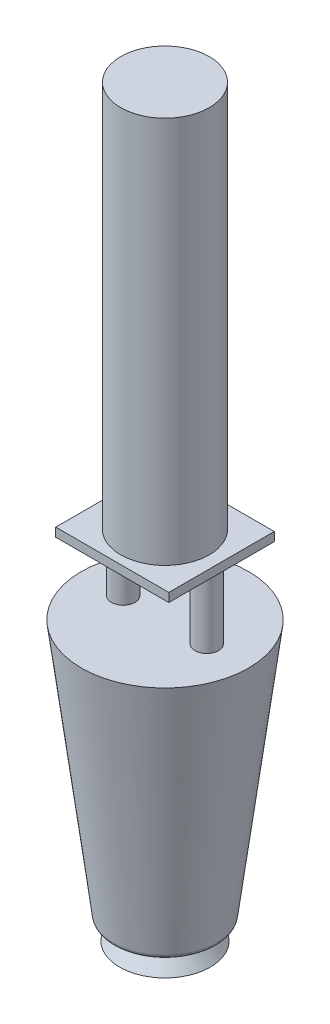
ISO-10303-21;
HEADER;
FILE_DESCRIPTION(('STEP AP214'),'2;1');
FILE_NAME('part.step','',(''),(''),'','','');
FILE_SCHEMA(('AUTOMOTIVE_DESIGN { 1 0 10303 214 1 1 1 1 }'));
ENDSEC;
DATA;
#1=APPLICATION_CONTEXT('core data for automotive mechanical design processes');
#2=APPLICATION_PROTOCOL_DEFINITION('international standard','automotive_design',2000,#1);
#3=PRODUCT_CONTEXT('',#1,'mechanical');
#4=PRODUCT('Part','Part','',(#3));
#5=PRODUCT_RELATED_PRODUCT_CATEGORY('part','',(#4));
#6=PRODUCT_DEFINITION_FORMATION('','',#4);
#7=PRODUCT_DEFINITION_CONTEXT('part definition',#1,'design');
#8=PRODUCT_DEFINITION('design','',#6,#7);
#9=PRODUCT_DEFINITION_SHAPE('','',#8);
#10=(LENGTH_UNIT() NAMED_UNIT(*) SI_UNIT(.MILLI.,.METRE.));
#11=(NAMED_UNIT(*) PLANE_ANGLE_UNIT() SI_UNIT($,.RADIAN.));
#12=(NAMED_UNIT(*) SI_UNIT($,.STERADIAN.) SOLID_ANGLE_UNIT());
#13=UNCERTAINTY_MEASURE_WITH_UNIT(LENGTH_MEASURE(1.E-05),#10,'distance_accuracy_value','');
#14=(GEOMETRIC_REPRESENTATION_CONTEXT(3) GLOBAL_UNCERTAINTY_ASSIGNED_CONTEXT((#13)) GLOBAL_UNIT_ASSIGNED_CONTEXT((#10,
#11,#12)) REPRESENTATION_CONTEXT('',''));
#15=CARTESIAN_POINT('',(0.,0.,0.));
#16=DIRECTION('',(0.,0.,1.));
#17=DIRECTION('',(1.,0.,0.));
#18=AXIS2_PLACEMENT_3D('',#15,#16,#17);
#19=CARTESIAN_POINT('',(10.3081724625253,0.,0.));
#20=DIRECTION('',(0.,-1.,0.));
#21=DIRECTION('',(0.,0.,-1.));
#22=AXIS2_PLACEMENT_3D('',#19,#20,#21);
#23=PLANE('',#22);
#24=CARTESIAN_POINT('',(0.,0.,0.));
#25=DIRECTION('',(0.,-1.,0.));
#26=DIRECTION('',(0.,0.,-1.));
#27=AXIS2_PLACEMENT_3D('',#24,#25,#26);
#28=CIRCLE('',#27,10.3081724625253);
#29=CARTESIAN_POINT('',(0.,0.,-10.3081724625253));
#30=VERTEX_POINT('',#29);
#31=EDGE_CURVE('E121',#30,#30,#28,.T.);
#32=ORIENTED_EDGE('',*,*,#31,.T.);
#33=EDGE_LOOP('',(#32));
#34=FACE_BOUND('',#33,.T.);
#35=ADVANCED_FACE('F39',(#34),#23,.T.);
#36=CARTESIAN_POINT('',(0.,63.2,0.));
#37=DIRECTION('',(0.,1.,0.));
#38=DIRECTION('',(0.,0.,1.));
#39=AXIS2_PLACEMENT_3D('',#36,#37,#38);
#40=PLANE('',#39);
#41=CARTESIAN_POINT('',(-9.4887541244929,63.2,0.));
#42=DIRECTION('',(0.,1.,0.));
#43=DIRECTION('',(0.,0.,1.));
#44=AXIS2_PLACEMENT_3D('',#41,#42,#43);
#45=CIRCLE('',#44,2.67336269963787);
#46=CARTESIAN_POINT('',(-9.4887541244929,63.2,2.67336269963787));
#47=VERTEX_POINT('',#46);
#48=EDGE_CURVE('E11',#47,#47,#45,.T.);
#49=ORIENTED_EDGE('',*,*,#48,.F.);
#50=EDGE_LOOP('',(#49));
#51=FACE_BOUND('',#50,.T.);
#52=CARTESIAN_POINT('',(9.4887541244929,63.2,0.));
#53=DIRECTION('',(0.,1.,0.));
#54=DIRECTION('',(0.,0.,1.));
#55=AXIS2_PLACEMENT_3D('',#52,#53,#54);
#56=CIRCLE('',#55,2.67336269963787);
#57=CARTESIAN_POINT('',(9.4887541244929,63.2,2.67336269963787));
#58=VERTEX_POINT('',#57);
#59=EDGE_CURVE('E48',#58,#58,#56,.T.);
#60=ORIENTED_EDGE('',*,*,#59,.F.);
#61=EDGE_LOOP('',(#60));
#62=FACE_BOUND('',#61,.T.);
#63=CARTESIAN_POINT('',(0.,63.2,0.));
#64=DIRECTION('',(0.,-1.,0.));
#65=DIRECTION('',(0.,0.,-1.));
#66=AXIS2_PLACEMENT_3D('',#63,#64,#65);
#67=CIRCLE('',#66,19.);
#68=CARTESIAN_POINT('',(0.,63.2,-19.));
#69=VERTEX_POINT('',#68);
#70=EDGE_CURVE('E129',#69,#69,#67,.T.);
#71=ORIENTED_EDGE('',*,*,#70,.F.);
#72=EDGE_LOOP('',(#71));
#73=FACE_BOUND('',#72,.T.);
#74=ADVANCED_FACE('F142',(#51,#62,#73),#40,.T.);
#75=CARTESIAN_POINT('',(0.,4.55529285160393,0.));
#76=DIRECTION('',(0.,1.,0.));
#77=DIRECTION('',(0.,0.,1.));
#78=AXIS2_PLACEMENT_3D('',#75,#76,#77);
#79=CONICAL_SURFACE('',#78,11.588395286118,0.125714986083952);
#80=CARTESIAN_POINT('',(0.,5.42990874262173,0.));
#81=DIRECTION('',(0.,-1.,0.));
#82=DIRECTION('',(0.,0.,-1.));
#83=AXIS2_PLACEMENT_3D('',#80,#81,#82);
#84=CIRCLE('',#83,11.6989305343255);
#85=CARTESIAN_POINT('',(0.,5.42990874262173,-11.6989305343255));
#86=VERTEX_POINT('',#85);
#87=EDGE_CURVE('E135',#86,#86,#84,.F.);
#88=ORIENTED_EDGE('',*,*,#87,.T.);
#89=EDGE_LOOP('',(#88));
#90=FACE_BOUND('',#89,.T.);
#91=ORIENTED_EDGE('',*,*,#70,.T.);
#92=EDGE_LOOP('',(#91));
#93=FACE_BOUND('',#92,.T.);
#94=ADVANCED_FACE('F145',(#90,#93),#79,.T.);
#95=CARTESIAN_POINT('',(11.588395286118,4.55529285160393,0.));
#96=DIRECTION('',(0.,-1.,0.));
#97=DIRECTION('',(0.,0.,-1.));
#98=AXIS2_PLACEMENT_3D('',#95,#96,#97);
#99=PLANE('',#98);
#100=CARTESIAN_POINT('',(0.,4.55529285160393,0.));
#101=DIRECTION('',(0.,-1.,0.));
#102=DIRECTION('',(0.,0.,-1.));
#103=AXIS2_PLACEMENT_3D('',#100,#101,#102);
#104=CIRCLE('',#103,10.7068222613962);
#105=CARTESIAN_POINT('',(0.,4.55529285160393,-10.7068222613962));
#106=VERTEX_POINT('',#105);
#107=EDGE_CURVE('E132',#106,#106,#104,.T.);
#108=ORIENTED_EDGE('',*,*,#107,.T.);
#109=EDGE_LOOP('',(#108));
#110=FACE_BOUND('',#109,.T.);
#111=CARTESIAN_POINT('',(0.,4.55529285160393,0.));
#112=DIRECTION('',(0.,-1.,0.));
#113=DIRECTION('',(0.,0.,-1.));
#114=AXIS2_PLACEMENT_3D('',#111,#112,#113);
#115=CIRCLE('',#114,6.62753184469628);
#116=CARTESIAN_POINT('',(0.,4.55529285160393,-6.62753184469628));
#117=VERTEX_POINT('',#116);
#118=EDGE_CURVE('E126',#117,#117,#115,.T.);
#119=ORIENTED_EDGE('',*,*,#118,.F.);
#120=EDGE_LOOP('',(#119));
#121=FACE_BOUND('',#120,.T.);
#122=ADVANCED_FACE('F151',(#110,#121),#99,.T.);
#123=CARTESIAN_POINT('',(0.,0.,0.));
#124=DIRECTION('',(0.,-1.,0.));
#125=DIRECTION('',(0.,0.,-1.));
#126=AXIS2_PLACEMENT_3D('',#123,#124,#125);
#127=CONICAL_SURFACE('',#126,10.3081724625253,0.679595208288886);
#128=ORIENTED_EDGE('',*,*,#118,.T.);
#129=EDGE_LOOP('',(#128));
#130=FACE_BOUND('',#129,.T.);
#131=ORIENTED_EDGE('',*,*,#31,.F.);
#132=EDGE_LOOP('',(#131));
#133=FACE_BOUND('',#132,.T.);
#134=ADVANCED_FACE('F157',(#130,#133),#127,.T.);
#135=CARTESIAN_POINT('',(0.,5.55529285160393,0.));
#136=DIRECTION('',(0.,-1.,0.));
#137=DIRECTION('',(0.,0.,-1.));
#138=AXIS2_PLACEMENT_3D('',#135,#136,#137);
#139=TOROIDAL_SURFACE('',#138,10.7068222613962,1.);
#140=ORIENTED_EDGE('',*,*,#87,.F.);
#141=EDGE_LOOP('',(#140));
#142=FACE_BOUND('',#141,.T.);
#143=ORIENTED_EDGE('',*,*,#107,.F.);
#144=EDGE_LOOP('',(#143));
#145=FACE_BOUND('',#144,.T.);
#146=ADVANCED_FACE('F41',(#142,#145),#139,.T.);
#147=CARTESIAN_POINT('',(9.4887541244929,63.2,0.));
#148=DIRECTION('',(0.,-1.,0.));
#149=DIRECTION('',(0.,0.,-1.));
#150=AXIS2_PLACEMENT_3D('',#147,#148,#149);
#151=CYLINDRICAL_SURFACE('',#150,2.67336269963787);
#152=CARTESIAN_POINT('',(9.4887541244929,79.,0.));
#153=DIRECTION('',(0.,-1.,0.));
#154=DIRECTION('',(0.,0.,-1.));
#155=AXIS2_PLACEMENT_3D('',#152,#153,#154);
#156=CIRCLE('',#155,2.67336269963787);
#157=CARTESIAN_POINT('',(9.4887541244929,79.,-2.67336269963787));
#158=VERTEX_POINT('',#157);
#159=EDGE_CURVE('E117',#158,#158,#156,.T.);
#160=ORIENTED_EDGE('',*,*,#159,.T.);
#161=EDGE_LOOP('',(#160));
#162=FACE_BOUND('',#161,.T.);
#163=ORIENTED_EDGE('',*,*,#59,.T.);
#164=EDGE_LOOP('',(#163));
#165=FACE_BOUND('',#164,.T.);
#166=ADVANCED_FACE('F140',(#162,#165),#151,.T.);
#167=CARTESIAN_POINT('',(-9.4887541244929,63.2,0.));
#168=DIRECTION('',(0.,-1.,0.));
#169=DIRECTION('',(0.,0.,-1.));
#170=AXIS2_PLACEMENT_3D('',#167,#168,#169);
#171=CYLINDRICAL_SURFACE('',#170,2.67336269963787);
#172=CARTESIAN_POINT('',(-9.4887541244929,79.,0.));
#173=DIRECTION('',(0.,1.,0.));
#174=DIRECTION('',(0.,0.,-1.));
#175=AXIS2_PLACEMENT_3D('',#172,#173,#174);
#176=CIRCLE('',#175,2.67336269963787);
#177=CARTESIAN_POINT('',(-9.4887541244929,79.,-2.67336269963787));
#178=VERTEX_POINT('',#177);
#179=EDGE_CURVE('E118',#178,#178,#176,.T.);
#180=ORIENTED_EDGE('',*,*,#179,.F.);
#181=EDGE_LOOP('',(#180));
#182=FACE_BOUND('',#181,.T.);
#183=ORIENTED_EDGE('',*,*,#48,.T.);
#184=EDGE_LOOP('',(#183));
#185=FACE_BOUND('',#184,.T.);
#186=ADVANCED_FACE('F176',(#182,#185),#171,.T.);
#187=CARTESIAN_POINT('',(0.,79.,0.));
#188=DIRECTION('',(0.,-1.,0.));
#189=DIRECTION('',(0.,0.,-1.));
#190=AXIS2_PLACEMENT_3D('',#187,#188,#189);
#191=PLANE('',#190);
#192=ORIENTED_EDGE('',*,*,#179,.T.);
#193=EDGE_LOOP('',(#192));
#194=FACE_BOUND('',#193,.T.);
#195=DIRECTION('',(0.,0.,-1.));
#196=VECTOR('',#195,1.);
#197=CARTESIAN_POINT('',(12.8452737027014,79.,11.9793001946544));
#198=LINE('',#197,#196);
#199=CARTESIAN_POINT('',(12.8452737027014,79.,11.9793001946544));
#200=VERTEX_POINT('',#199);
#201=CARTESIAN_POINT('',(12.8452737027014,79.,-11.9793001946544));
#202=VERTEX_POINT('',#201);
#203=EDGE_CURVE('E107',#200,#202,#198,.T.);
#204=ORIENTED_EDGE('',*,*,#203,.F.);
#205=DIRECTION('',(1.,0.,0.));
#206=VECTOR('',#205,1.);
#207=CARTESIAN_POINT('',(-12.8452737027014,79.,11.9793001946544));
#208=LINE('',#207,#206);
#209=CARTESIAN_POINT('',(-12.8452737027014,79.,11.9793001946544));
#210=VERTEX_POINT('',#209);
#211=EDGE_CURVE('E79',#210,#200,#208,.T.);
#212=ORIENTED_EDGE('',*,*,#211,.F.);
#213=DIRECTION('',(0.,0.,1.));
#214=VECTOR('',#213,1.);
#215=CARTESIAN_POINT('',(-12.8452737027014,79.,11.9793001946544));
#216=LINE('',#215,#214);
#217=CARTESIAN_POINT('',(-12.8452737027014,79.,-11.9793001946544));
#218=VERTEX_POINT('',#217);
#219=EDGE_CURVE('E73',#218,#210,#216,.T.);
#220=ORIENTED_EDGE('',*,*,#219,.F.);
#221=DIRECTION('',(-1.,0.,0.));
#222=VECTOR('',#221,1.);
#223=CARTESIAN_POINT('',(-12.8452737027014,79.,-11.9793001946544));
#224=LINE('',#223,#222);
#225=EDGE_CURVE('E97',#202,#218,#224,.T.);
#226=ORIENTED_EDGE('',*,*,#225,.F.);
#227=EDGE_LOOP('',(#204,#212,#220,#226));
#228=FACE_BOUND('',#227,.T.);
#229=ORIENTED_EDGE('',*,*,#159,.F.);
#230=EDGE_LOOP('',(#229));
#231=FACE_BOUND('',#230,.T.);
#232=ADVANCED_FACE('F180',(#194,#228,#231),#191,.T.);
#233=CARTESIAN_POINT('',(12.8452737027014,81.,11.9793001946544));
#234=DIRECTION('',(-1.,0.,0.));
#235=DIRECTION('',(0.,0.,1.));
#236=AXIS2_PLACEMENT_3D('',#233,#234,#235);
#237=PLANE('',#236);
#238=ORIENTED_EDGE('',*,*,#203,.T.);
#239=DIRECTION('',(0.,-1.,0.));
#240=VECTOR('',#239,1.);
#241=CARTESIAN_POINT('',(12.8452737027014,81.,-11.9793001946544));
#242=LINE('',#241,#240);
#243=CARTESIAN_POINT('',(12.8452737027014,81.,-11.9793001946544));
#244=VERTEX_POINT('',#243);
#245=EDGE_CURVE('E98',#244,#202,#242,.T.);
#246=ORIENTED_EDGE('',*,*,#245,.F.);
#247=DIRECTION('',(0.,0.,-1.));
#248=VECTOR('',#247,1.);
#249=CARTESIAN_POINT('',(12.8452737027014,81.,11.9793001946544));
#250=LINE('',#249,#248);
#251=CARTESIAN_POINT('',(12.8452737027014,81.,11.9793001946544));
#252=VERTEX_POINT('',#251);
#253=EDGE_CURVE('E92',#252,#244,#250,.T.);
#254=ORIENTED_EDGE('',*,*,#253,.F.);
#255=DIRECTION('',(0.,-1.,0.));
#256=VECTOR('',#255,1.);
#257=CARTESIAN_POINT('',(12.8452737027014,81.,11.9793001946544));
#258=LINE('',#257,#256);
#259=EDGE_CURVE('E103',#252,#200,#258,.T.);
#260=ORIENTED_EDGE('',*,*,#259,.T.);
#261=EDGE_LOOP('',(#238,#246,#254,#260));
#262=FACE_BOUND('',#261,.T.);
#263=ADVANCED_FACE('F182',(#262),#237,.F.);
#264=CARTESIAN_POINT('',(-12.8452737027014,81.,-11.9793001946544));
#265=DIRECTION('',(0.,0.,1.));
#266=DIRECTION('',(1.,0.,0.));
#267=AXIS2_PLACEMENT_3D('',#264,#265,#266);
#268=PLANE('',#267);
#269=ORIENTED_EDGE('',*,*,#225,.T.);
#270=DIRECTION('',(0.,-1.,0.));
#271=VECTOR('',#270,1.);
#272=CARTESIAN_POINT('',(-12.8452737027014,81.,-11.9793001946544));
#273=LINE('',#272,#271);
#274=CARTESIAN_POINT('',(-12.8452737027014,81.,-11.9793001946544));
#275=VERTEX_POINT('',#274);
#276=EDGE_CURVE('E95',#275,#218,#273,.T.);
#277=ORIENTED_EDGE('',*,*,#276,.F.);
#278=DIRECTION('',(-1.,0.,0.));
#279=VECTOR('',#278,1.);
#280=CARTESIAN_POINT('',(-12.8452737027014,81.,-11.9793001946544));
#281=LINE('',#280,#279);
#282=EDGE_CURVE('E87',#244,#275,#281,.T.);
#283=ORIENTED_EDGE('',*,*,#282,.F.);
#284=ORIENTED_EDGE('',*,*,#245,.T.);
#285=EDGE_LOOP('',(#269,#277,#283,#284));
#286=FACE_BOUND('',#285,.T.);
#287=ADVANCED_FACE('F96',(#286),#268,.F.);
#288=CARTESIAN_POINT('',(-12.8452737027014,81.,11.9793001946544));
#289=DIRECTION('',(1.,0.,0.));
#290=DIRECTION('',(0.,0.,-1.));
#291=AXIS2_PLACEMENT_3D('',#288,#289,#290);
#292=PLANE('',#291);
#293=ORIENTED_EDGE('',*,*,#219,.T.);
#294=DIRECTION('',(0.,-1.,0.));
#295=VECTOR('',#294,1.);
#296=CARTESIAN_POINT('',(-12.8452737027014,81.,11.9793001946544));
#297=LINE('',#296,#295);
#298=CARTESIAN_POINT('',(-12.8452737027014,81.,11.9793001946544));
#299=VERTEX_POINT('',#298);
#300=EDGE_CURVE('E99',#299,#210,#297,.T.);
#301=ORIENTED_EDGE('',*,*,#300,.F.);
#302=DIRECTION('',(0.,0.,1.));
#303=VECTOR('',#302,1.);
#304=CARTESIAN_POINT('',(-12.8452737027014,81.,11.9793001946544));
#305=LINE('',#304,#303);
#306=EDGE_CURVE('E90',#275,#299,#305,.T.);
#307=ORIENTED_EDGE('',*,*,#306,.F.);
#308=ORIENTED_EDGE('',*,*,#276,.T.);
#309=EDGE_LOOP('',(#293,#301,#307,#308));
#310=FACE_BOUND('',#309,.T.);
#311=ADVANCED_FACE('F101',(#310),#292,.F.);
#312=CARTESIAN_POINT('',(-12.8452737027014,81.,11.9793001946544));
#313=DIRECTION('',(0.,0.,-1.));
#314=DIRECTION('',(-1.,0.,0.));
#315=AXIS2_PLACEMENT_3D('',#312,#313,#314);
#316=PLANE('',#315);
#317=ORIENTED_EDGE('',*,*,#211,.T.);
#318=ORIENTED_EDGE('',*,*,#259,.F.);
#319=DIRECTION('',(1.,0.,0.));
#320=VECTOR('',#319,1.);
#321=CARTESIAN_POINT('',(-12.8452737027014,81.,11.9793001946544));
#322=LINE('',#321,#320);
#323=EDGE_CURVE('E56',#299,#252,#322,.T.);
#324=ORIENTED_EDGE('',*,*,#323,.F.);
#325=ORIENTED_EDGE('',*,*,#300,.T.);
#326=EDGE_LOOP('',(#317,#318,#324,#325));
#327=FACE_BOUND('',#326,.T.);
#328=ADVANCED_FACE('F190',(#327),#316,.F.);
#329=CARTESIAN_POINT('',(0.,81.,0.));
#330=DIRECTION('',(0.,-1.,0.));
#331=DIRECTION('',(0.,0.,-1.));
#332=AXIS2_PLACEMENT_3D('',#329,#330,#331);
#333=PLANE('',#332);
#334=CARTESIAN_POINT('',(0.,81.,0.));
#335=DIRECTION('',(0.,-1.,0.));
#336=DIRECTION('',(0.,0.,-1.));
#337=AXIS2_PLACEMENT_3D('',#334,#335,#336);
#338=CIRCLE('',#337,10.0570846032983);
#339=CARTESIAN_POINT('',(0.,81.,-10.0570846032983));
#340=VERTEX_POINT('',#339);
#341=EDGE_CURVE('E213',#340,#340,#338,.T.);
#342=ORIENTED_EDGE('',*,*,#341,.T.);
#343=EDGE_LOOP('',(#342));
#344=FACE_BOUND('',#343,.T.);
#345=ORIENTED_EDGE('',*,*,#253,.T.);
#346=ORIENTED_EDGE('',*,*,#282,.T.);
#347=ORIENTED_EDGE('',*,*,#306,.T.);
#348=ORIENTED_EDGE('',*,*,#323,.T.);
#349=EDGE_LOOP('',(#345,#346,#347,#348));
#350=FACE_BOUND('',#349,.T.);
#351=ADVANCED_FACE('F88',(#344,#350),#333,.F.);
#352=CARTESIAN_POINT('',(0.,169.,0.));
#353=DIRECTION('',(0.,1.,0.));
#354=DIRECTION('',(0.,0.,1.));
#355=AXIS2_PLACEMENT_3D('',#352,#353,#354);
#356=PLANE('',#355);
#357=CARTESIAN_POINT('',(0.,169.,0.));
#358=DIRECTION('',(0.,-1.,0.));
#359=DIRECTION('',(0.,0.,-1.));
#360=AXIS2_PLACEMENT_3D('',#357,#358,#359);
#361=CIRCLE('',#360,10.0570846032983);
#362=CARTESIAN_POINT('',(0.,169.,-10.0570846032983));
#363=VERTEX_POINT('',#362);
#364=EDGE_CURVE('E110',#363,#363,#361,.T.);
#365=ORIENTED_EDGE('',*,*,#364,.F.);
#366=EDGE_LOOP('',(#365));
#367=FACE_BOUND('',#366,.T.);
#368=ADVANCED_FACE('F198',(#367),#356,.T.);
#369=CARTESIAN_POINT('',(0.,81.,0.));
#370=DIRECTION('',(0.,-1.,0.));
#371=DIRECTION('',(0.,0.,-1.));
#372=AXIS2_PLACEMENT_3D('',#369,#370,#371);
#373=CYLINDRICAL_SURFACE('',#372,10.0570846032983);
#374=ORIENTED_EDGE('',*,*,#364,.T.);
#375=EDGE_LOOP('',(#374));
#376=FACE_BOUND('',#375,.T.);
#377=ORIENTED_EDGE('',*,*,#341,.F.);
#378=EDGE_LOOP('',(#377));
#379=FACE_BOUND('',#378,.T.);
#380=ADVANCED_FACE('F202',(#376,#379),#373,.T.);
#381=CLOSED_SHELL('',(#35,#74,#94,#122,#134,#146,#166,#186,#232,#263,#287,#311,#328,#351,#368,#380));
#382=MANIFOLD_SOLID_BREP('B2',#381);
#383=ADVANCED_BREP_SHAPE_REPRESENTATION('',(#18,#382),#14);
#384=SHAPE_DEFINITION_REPRESENTATION(#9,#383);
ENDSEC;
END-ISO-10303-21;
